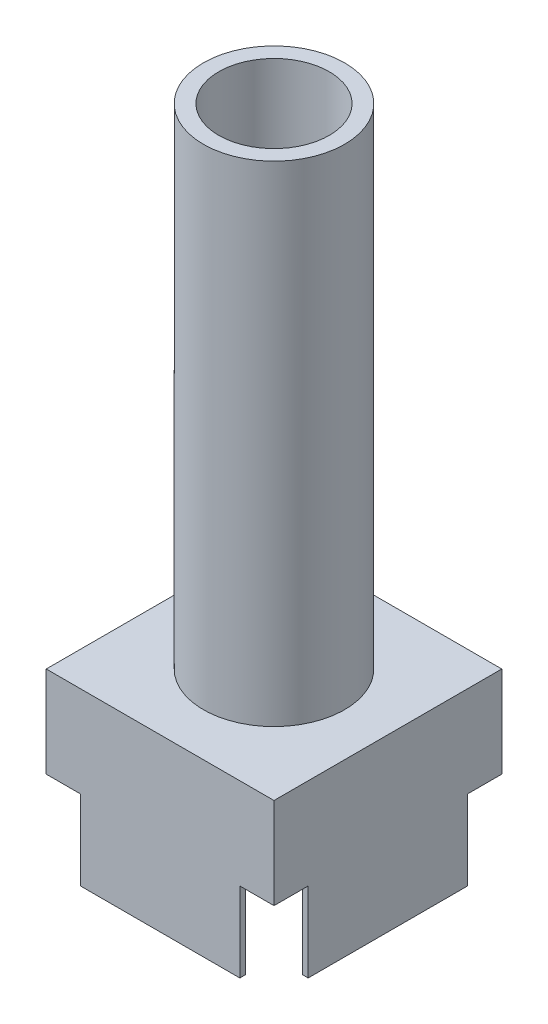
ISO-10303-21;
HEADER;
FILE_DESCRIPTION(('STEP AP214'),'2;1');
FILE_NAME('part.step','',(''),(''),'','','');
FILE_SCHEMA(('AUTOMOTIVE_DESIGN { 1 0 10303 214 1 1 1 1 }'));
ENDSEC;
DATA;
#1=APPLICATION_CONTEXT('core data for automotive mechanical design processes');
#2=APPLICATION_PROTOCOL_DEFINITION('international standard','automotive_design',2000,#1);
#3=PRODUCT_CONTEXT('',#1,'mechanical');
#4=PRODUCT('Part','Part','',(#3));
#5=PRODUCT_RELATED_PRODUCT_CATEGORY('part','',(#4));
#6=PRODUCT_DEFINITION_FORMATION('','',#4);
#7=PRODUCT_DEFINITION_CONTEXT('part definition',#1,'design');
#8=PRODUCT_DEFINITION('design','',#6,#7);
#9=PRODUCT_DEFINITION_SHAPE('','',#8);
#10=(LENGTH_UNIT() NAMED_UNIT(*) SI_UNIT(.MILLI.,.METRE.));
#11=(NAMED_UNIT(*) PLANE_ANGLE_UNIT() SI_UNIT($,.RADIAN.));
#12=(NAMED_UNIT(*) SI_UNIT($,.STERADIAN.) SOLID_ANGLE_UNIT());
#13=UNCERTAINTY_MEASURE_WITH_UNIT(LENGTH_MEASURE(1.E-05),#10,'distance_accuracy_value','');
#14=(GEOMETRIC_REPRESENTATION_CONTEXT(3) GLOBAL_UNCERTAINTY_ASSIGNED_CONTEXT((#13)) GLOBAL_UNIT_ASSIGNED_CONTEXT((#10,
#11,#12)) REPRESENTATION_CONTEXT('',''));
#15=CARTESIAN_POINT('',(0.,0.,0.));
#16=DIRECTION('',(0.,0.,1.));
#17=DIRECTION('',(1.,0.,0.));
#18=AXIS2_PLACEMENT_3D('',#15,#16,#17);
#19=CARTESIAN_POINT('',(0.,0.,0.));
#20=DIRECTION('',(0.,-1.,0.));
#21=DIRECTION('',(0.,0.,-1.));
#22=AXIS2_PLACEMENT_3D('',#19,#20,#21);
#23=PLANE('',#22);
#24=DIRECTION('',(1.,0.,0.));
#25=VECTOR('',#24,1.);
#26=CARTESIAN_POINT('',(0.,0.,-3.));
#27=LINE('',#26,#25);
#28=CARTESIAN_POINT('',(0.,0.,-3.));
#29=VERTEX_POINT('',#28);
#30=CARTESIAN_POINT('',(0.5,0.,-3.));
#31=VERTEX_POINT('',#30);
#32=EDGE_CURVE('E272',#29,#31,#27,.T.);
#33=ORIENTED_EDGE('',*,*,#32,.F.);
#34=DIRECTION('',(0.,0.,1.));
#35=VECTOR('',#34,1.);
#36=CARTESIAN_POINT('',(0.,0.,0.));
#37=LINE('',#36,#35);
#38=CARTESIAN_POINT('',(0.,0.,-17.));
#39=VERTEX_POINT('',#38);
#40=EDGE_CURVE('E324',#39,#29,#37,.T.);
#41=ORIENTED_EDGE('',*,*,#40,.F.);
#42=DIRECTION('',(-1.,0.,0.));
#43=VECTOR('',#42,1.);
#44=CARTESIAN_POINT('',(0.,0.,-17.));
#45=LINE('',#44,#43);
#46=CARTESIAN_POINT('',(0.5,0.,-17.));
#47=VERTEX_POINT('',#46);
#48=EDGE_CURVE('E290',#47,#39,#45,.T.);
#49=ORIENTED_EDGE('',*,*,#48,.F.);
#50=DIRECTION('',(0.,0.,1.));
#51=VECTOR('',#50,1.);
#52=CARTESIAN_POINT('',(0.5,0.,-0.5));
#53=LINE('',#52,#51);
#54=EDGE_CURVE('E312',#47,#31,#53,.T.);
#55=ORIENTED_EDGE('',*,*,#54,.T.);
#56=EDGE_LOOP('',(#33,#41,#49,#55));
#57=FACE_BOUND('',#56,.T.);
#58=ADVANCED_FACE('F33',(#57),#23,.T.);
#59=DIRECTION('',(-1.,0.,0.));
#60=VECTOR('',#59,1.);
#61=CARTESIAN_POINT('',(0.,0.,-17.));
#62=LINE('',#61,#60);
#63=CARTESIAN_POINT('',(20.,0.,-17.));
#64=VERTEX_POINT('',#63);
#65=CARTESIAN_POINT('',(19.5,0.,-17.));
#66=VERTEX_POINT('',#65);
#67=EDGE_CURVE('E264',#64,#66,#62,.T.);
#68=ORIENTED_EDGE('',*,*,#67,.F.);
#69=DIRECTION('',(0.,0.,-1.));
#70=VECTOR('',#69,1.);
#71=CARTESIAN_POINT('',(20.,0.,0.));
#72=LINE('',#71,#70);
#73=CARTESIAN_POINT('',(20.,0.,-3.));
#74=VERTEX_POINT('',#73);
#75=EDGE_CURVE('E338',#74,#64,#72,.T.);
#76=ORIENTED_EDGE('',*,*,#75,.F.);
#77=DIRECTION('',(1.,0.,0.));
#78=VECTOR('',#77,1.);
#79=CARTESIAN_POINT('',(0.,0.,-3.));
#80=LINE('',#79,#78);
#81=CARTESIAN_POINT('',(19.5,0.,-3.));
#82=VERTEX_POINT('',#81);
#83=EDGE_CURVE('E252',#82,#74,#80,.T.);
#84=ORIENTED_EDGE('',*,*,#83,.F.);
#85=DIRECTION('',(0.,0.,-1.));
#86=VECTOR('',#85,1.);
#87=CARTESIAN_POINT('',(19.5,0.,-0.5));
#88=LINE('',#87,#86);
#89=EDGE_CURVE('E330',#82,#66,#88,.T.);
#90=ORIENTED_EDGE('',*,*,#89,.T.);
#91=EDGE_LOOP('',(#68,#76,#84,#90));
#92=FACE_BOUND('',#91,.T.);
#93=ADVANCED_FACE('F381',(#92),#23,.T.);
#94=DIRECTION('',(0.,0.,1.));
#95=VECTOR('',#94,1.);
#96=CARTESIAN_POINT('',(3.,0.,0.));
#97=LINE('',#96,#95);
#98=CARTESIAN_POINT('',(3.,0.,-0.5));
#99=VERTEX_POINT('',#98);
#100=CARTESIAN_POINT('',(3.,0.,0.));
#101=VERTEX_POINT('',#100);
#102=EDGE_CURVE('E268',#99,#101,#97,.T.);
#103=ORIENTED_EDGE('',*,*,#102,.F.);
#104=DIRECTION('',(1.,0.,0.));
#105=VECTOR('',#104,1.);
#106=CARTESIAN_POINT('',(0.5,0.,-0.5));
#107=LINE('',#106,#105);
#108=CARTESIAN_POINT('',(17.,0.,-0.5));
#109=VERTEX_POINT('',#108);
#110=EDGE_CURVE('E327',#99,#109,#107,.T.);
#111=ORIENTED_EDGE('',*,*,#110,.T.);
#112=DIRECTION('',(0.,0.,-1.));
#113=VECTOR('',#112,1.);
#114=CARTESIAN_POINT('',(17.,0.,0.));
#115=LINE('',#114,#113);
#116=CARTESIAN_POINT('',(17.,0.,0.));
#117=VERTEX_POINT('',#116);
#118=EDGE_CURVE('E256',#117,#109,#115,.T.);
#119=ORIENTED_EDGE('',*,*,#118,.F.);
#120=DIRECTION('',(1.,0.,0.));
#121=VECTOR('',#120,1.);
#122=CARTESIAN_POINT('',(0.,0.,0.));
#123=LINE('',#122,#121);
#124=EDGE_CURVE('E335',#101,#117,#123,.T.);
#125=ORIENTED_EDGE('',*,*,#124,.F.);
#126=EDGE_LOOP('',(#103,#111,#119,#125));
#127=FACE_BOUND('',#126,.T.);
#128=ADVANCED_FACE('F386',(#127),#23,.T.);
#129=DIRECTION('',(0.,0.,-1.));
#130=VECTOR('',#129,1.);
#131=CARTESIAN_POINT('',(17.,0.,0.));
#132=LINE('',#131,#130);
#133=CARTESIAN_POINT('',(17.,0.,-19.5));
#134=VERTEX_POINT('',#133);
#135=CARTESIAN_POINT('',(17.,0.,-20.));
#136=VERTEX_POINT('',#135);
#137=EDGE_CURVE('E260',#134,#136,#132,.T.);
#138=ORIENTED_EDGE('',*,*,#137,.F.);
#139=DIRECTION('',(-1.,0.,0.));
#140=VECTOR('',#139,1.);
#141=CARTESIAN_POINT('',(0.5,0.,-19.5));
#142=LINE('',#141,#140);
#143=CARTESIAN_POINT('',(3.,0.,-19.5));
#144=VERTEX_POINT('',#143);
#145=EDGE_CURVE('E317',#134,#144,#142,.T.);
#146=ORIENTED_EDGE('',*,*,#145,.T.);
#147=DIRECTION('',(0.,0.,1.));
#148=VECTOR('',#147,1.);
#149=CARTESIAN_POINT('',(3.,0.,0.));
#150=LINE('',#149,#148);
#151=CARTESIAN_POINT('',(3.,0.,-20.));
#152=VERTEX_POINT('',#151);
#153=EDGE_CURVE('E295',#152,#144,#150,.T.);
#154=ORIENTED_EDGE('',*,*,#153,.F.);
#155=DIRECTION('',(-1.,0.,0.));
#156=VECTOR('',#155,1.);
#157=CARTESIAN_POINT('',(0.,0.,-20.));
#158=LINE('',#157,#156);
#159=EDGE_CURVE('E201',#136,#152,#158,.T.);
#160=ORIENTED_EDGE('',*,*,#159,.F.);
#161=EDGE_LOOP('',(#138,#146,#154,#160));
#162=FACE_BOUND('',#161,.T.);
#163=ADVANCED_FACE('F347',(#162),#23,.T.);
#164=CARTESIAN_POINT('',(0.,7.,0.));
#165=DIRECTION('',(1.,0.,0.));
#166=DIRECTION('',(0.,0.,-1.));
#167=AXIS2_PLACEMENT_3D('',#164,#165,#166);
#168=PLANE('',#167);
#169=ORIENTED_EDGE('',*,*,#40,.T.);
#170=DIRECTION('',(0.,1.,0.));
#171=VECTOR('',#170,1.);
#172=CARTESIAN_POINT('',(0.,-3.,-3.));
#173=LINE('',#172,#171);
#174=CARTESIAN_POINT('',(0.,7.,-3.));
#175=VERTEX_POINT('',#174);
#176=EDGE_CURVE('E193',#29,#175,#173,.T.);
#177=ORIENTED_EDGE('',*,*,#176,.T.);
#178=DIRECTION('',(0.,0.,1.));
#179=VECTOR('',#178,1.);
#180=CARTESIAN_POINT('',(0.,7.,0.));
#181=LINE('',#180,#179);
#182=CARTESIAN_POINT('',(0.,7.,0.));
#183=VERTEX_POINT('',#182);
#184=EDGE_CURVE('E221',#175,#183,#181,.T.);
#185=ORIENTED_EDGE('',*,*,#184,.T.);
#186=DIRECTION('',(0.,-1.,0.));
#187=VECTOR('',#186,1.);
#188=CARTESIAN_POINT('',(0.,7.,0.));
#189=LINE('',#188,#187);
#190=CARTESIAN_POINT('',(0.,15.,0.));
#191=VERTEX_POINT('',#190);
#192=EDGE_CURVE('E41',#191,#183,#189,.T.);
#193=ORIENTED_EDGE('',*,*,#192,.F.);
#194=DIRECTION('',(0.,0.,1.));
#195=VECTOR('',#194,1.);
#196=CARTESIAN_POINT('',(0.,15.,0.));
#197=LINE('',#196,#195);
#198=CARTESIAN_POINT('',(0.,15.,-20.));
#199=VERTEX_POINT('',#198);
#200=EDGE_CURVE('E218',#199,#191,#197,.T.);
#201=ORIENTED_EDGE('',*,*,#200,.F.);
#202=DIRECTION('',(0.,-1.,0.));
#203=VECTOR('',#202,1.);
#204=CARTESIAN_POINT('',(0.,7.,-20.));
#205=LINE('',#204,#203);
#206=CARTESIAN_POINT('',(0.,7.,-20.));
#207=VERTEX_POINT('',#206);
#208=EDGE_CURVE('E56',#199,#207,#205,.T.);
#209=ORIENTED_EDGE('',*,*,#208,.T.);
#210=DIRECTION('',(0.,0.,1.));
#211=VECTOR('',#210,1.);
#212=CARTESIAN_POINT('',(0.,7.,-20.));
#213=LINE('',#212,#211);
#214=CARTESIAN_POINT('',(0.,7.,-17.));
#215=VERTEX_POINT('',#214);
#216=EDGE_CURVE('E274',#207,#215,#213,.T.);
#217=ORIENTED_EDGE('',*,*,#216,.T.);
#218=DIRECTION('',(0.,1.,0.));
#219=VECTOR('',#218,1.);
#220=CARTESIAN_POINT('',(0.,-3.,-17.));
#221=LINE('',#220,#219);
#222=EDGE_CURVE('E283',#39,#215,#221,.T.);
#223=ORIENTED_EDGE('',*,*,#222,.F.);
#224=EDGE_LOOP('',(#169,#177,#185,#193,#201,#209,#217,#223));
#225=FACE_BOUND('',#224,.T.);
#226=ADVANCED_FACE('F35',(#225),#168,.F.);
#227=CARTESIAN_POINT('',(0.,7.,0.));
#228=DIRECTION('',(0.,0.,-1.));
#229=DIRECTION('',(-1.,0.,0.));
#230=AXIS2_PLACEMENT_3D('',#227,#228,#229);
#231=PLANE('',#230);
#232=DIRECTION('',(1.,0.,0.));
#233=VECTOR('',#232,1.);
#234=CARTESIAN_POINT('',(0.,7.,0.));
#235=LINE('',#234,#233);
#236=CARTESIAN_POINT('',(3.,7.,0.));
#237=VERTEX_POINT('',#236);
#238=EDGE_CURVE('E210',#183,#237,#235,.T.);
#239=ORIENTED_EDGE('',*,*,#238,.T.);
#240=DIRECTION('',(0.,1.,0.));
#241=VECTOR('',#240,1.);
#242=CARTESIAN_POINT('',(3.,-3.,0.));
#243=LINE('',#242,#241);
#244=EDGE_CURVE('E232',#101,#237,#243,.T.);
#245=ORIENTED_EDGE('',*,*,#244,.F.);
#246=ORIENTED_EDGE('',*,*,#124,.T.);
#247=DIRECTION('',(0.,1.,0.));
#248=VECTOR('',#247,1.);
#249=CARTESIAN_POINT('',(17.,-3.,0.));
#250=LINE('',#249,#248);
#251=CARTESIAN_POINT('',(17.,7.,0.));
#252=VERTEX_POINT('',#251);
#253=EDGE_CURVE('E246',#117,#252,#250,.T.);
#254=ORIENTED_EDGE('',*,*,#253,.T.);
#255=DIRECTION('',(1.,0.,0.));
#256=VECTOR('',#255,1.);
#257=CARTESIAN_POINT('',(20.,7.,0.));
#258=LINE('',#257,#256);
#259=CARTESIAN_POINT('',(20.,7.,0.));
#260=VERTEX_POINT('',#259);
#261=EDGE_CURVE('E242',#252,#260,#258,.T.);
#262=ORIENTED_EDGE('',*,*,#261,.T.);
#263=DIRECTION('',(0.,-1.,0.));
#264=VECTOR('',#263,1.);
#265=CARTESIAN_POINT('',(20.,7.,0.));
#266=LINE('',#265,#264);
#267=CARTESIAN_POINT('',(20.,15.,0.));
#268=VERTEX_POINT('',#267);
#269=EDGE_CURVE('E197',#268,#260,#266,.T.);
#270=ORIENTED_EDGE('',*,*,#269,.F.);
#271=DIRECTION('',(1.,0.,0.));
#272=VECTOR('',#271,1.);
#273=CARTESIAN_POINT('',(0.,15.,0.));
#274=LINE('',#273,#272);
#275=EDGE_CURVE('E212',#191,#268,#274,.T.);
#276=ORIENTED_EDGE('',*,*,#275,.F.);
#277=ORIENTED_EDGE('',*,*,#192,.T.);
#278=EDGE_LOOP('',(#239,#245,#246,#254,#262,#270,#276,#277));
#279=FACE_BOUND('',#278,.T.);
#280=ADVANCED_FACE('F208',(#279),#231,.F.);
#281=CARTESIAN_POINT('',(20.,7.,0.));
#282=DIRECTION('',(-1.,0.,0.));
#283=DIRECTION('',(0.,0.,1.));
#284=AXIS2_PLACEMENT_3D('',#281,#282,#283);
#285=PLANE('',#284);
#286=ORIENTED_EDGE('',*,*,#75,.T.);
#287=DIRECTION('',(0.,1.,0.));
#288=VECTOR('',#287,1.);
#289=CARTESIAN_POINT('',(20.,-3.,-17.));
#290=LINE('',#289,#288);
#291=CARTESIAN_POINT('',(20.,7.,-17.));
#292=VERTEX_POINT('',#291);
#293=EDGE_CURVE('E192',#64,#292,#290,.T.);
#294=ORIENTED_EDGE('',*,*,#293,.T.);
#295=DIRECTION('',(0.,0.,-1.));
#296=VECTOR('',#295,1.);
#297=CARTESIAN_POINT('',(20.,7.,-20.));
#298=LINE('',#297,#296);
#299=CARTESIAN_POINT('',(20.,7.,-20.));
#300=VERTEX_POINT('',#299);
#301=EDGE_CURVE('E180',#292,#300,#298,.T.);
#302=ORIENTED_EDGE('',*,*,#301,.T.);
#303=DIRECTION('',(0.,-1.,0.));
#304=VECTOR('',#303,1.);
#305=CARTESIAN_POINT('',(20.,7.,-20.));
#306=LINE('',#305,#304);
#307=CARTESIAN_POINT('',(20.,15.,-20.));
#308=VERTEX_POINT('',#307);
#309=EDGE_CURVE('E190',#308,#300,#306,.T.);
#310=ORIENTED_EDGE('',*,*,#309,.F.);
#311=DIRECTION('',(0.,0.,-1.));
#312=VECTOR('',#311,1.);
#313=CARTESIAN_POINT('',(20.,15.,0.));
#314=LINE('',#313,#312);
#315=EDGE_CURVE('E309',#268,#308,#314,.T.);
#316=ORIENTED_EDGE('',*,*,#315,.F.);
#317=ORIENTED_EDGE('',*,*,#269,.T.);
#318=DIRECTION('',(0.,0.,-1.));
#319=VECTOR('',#318,1.);
#320=CARTESIAN_POINT('',(20.,7.,0.));
#321=LINE('',#320,#319);
#322=CARTESIAN_POINT('',(20.,7.,-3.));
#323=VERTEX_POINT('',#322);
#324=EDGE_CURVE('E235',#260,#323,#321,.T.);
#325=ORIENTED_EDGE('',*,*,#324,.T.);
#326=DIRECTION('',(0.,1.,0.));
#327=VECTOR('',#326,1.);
#328=CARTESIAN_POINT('',(20.,-3.,-3.));
#329=LINE('',#328,#327);
#330=EDGE_CURVE('E245',#74,#323,#329,.T.);
#331=ORIENTED_EDGE('',*,*,#330,.F.);
#332=EDGE_LOOP('',(#286,#294,#302,#310,#316,#317,#325,#331));
#333=FACE_BOUND('',#332,.T.);
#334=ADVANCED_FACE('F188',(#333),#285,.F.);
#335=CARTESIAN_POINT('',(0.,7.,-20.));
#336=DIRECTION('',(0.,0.,1.));
#337=DIRECTION('',(1.,0.,0.));
#338=AXIS2_PLACEMENT_3D('',#335,#336,#337);
#339=PLANE('',#338);
#340=DIRECTION('',(-1.,0.,0.));
#341=VECTOR('',#340,1.);
#342=CARTESIAN_POINT('',(20.,7.,-20.));
#343=LINE('',#342,#341);
#344=CARTESIAN_POINT('',(17.,7.,-20.));
#345=VERTEX_POINT('',#344);
#346=EDGE_CURVE('E175',#300,#345,#343,.T.);
#347=ORIENTED_EDGE('',*,*,#346,.T.);
#348=DIRECTION('',(0.,1.,0.));
#349=VECTOR('',#348,1.);
#350=CARTESIAN_POINT('',(17.,-3.,-20.));
#351=LINE('',#350,#349);
#352=EDGE_CURVE('E226',#136,#345,#351,.T.);
#353=ORIENTED_EDGE('',*,*,#352,.F.);
#354=ORIENTED_EDGE('',*,*,#159,.T.);
#355=DIRECTION('',(0.,1.,0.));
#356=VECTOR('',#355,1.);
#357=CARTESIAN_POINT('',(3.,-3.,-20.));
#358=LINE('',#357,#356);
#359=CARTESIAN_POINT('',(3.,7.,-20.));
#360=VERTEX_POINT('',#359);
#361=EDGE_CURVE('E284',#152,#360,#358,.T.);
#362=ORIENTED_EDGE('',*,*,#361,.T.);
#363=DIRECTION('',(-1.,0.,0.));
#364=VECTOR('',#363,1.);
#365=CARTESIAN_POINT('',(0.,7.,-20.));
#366=LINE('',#365,#364);
#367=EDGE_CURVE('E281',#360,#207,#366,.T.);
#368=ORIENTED_EDGE('',*,*,#367,.T.);
#369=ORIENTED_EDGE('',*,*,#208,.F.);
#370=DIRECTION('',(-1.,0.,0.));
#371=VECTOR('',#370,1.);
#372=CARTESIAN_POINT('',(0.,15.,-20.));
#373=LINE('',#372,#371);
#374=EDGE_CURVE('E196',#308,#199,#373,.T.);
#375=ORIENTED_EDGE('',*,*,#374,.F.);
#376=ORIENTED_EDGE('',*,*,#309,.T.);
#377=EDGE_LOOP('',(#347,#353,#354,#362,#368,#369,#375,#376));
#378=FACE_BOUND('',#377,.T.);
#379=ADVANCED_FACE('F195',(#378),#339,.F.);
#380=CARTESIAN_POINT('',(0.5,7.,-0.5));
#381=DIRECTION('',(1.,0.,0.));
#382=DIRECTION('',(0.,0.,-1.));
#383=AXIS2_PLACEMENT_3D('',#380,#381,#382);
#384=PLANE('',#383);
#385=DIRECTION('',(0.,1.,0.));
#386=VECTOR('',#385,1.);
#387=CARTESIAN_POINT('',(0.5,7.,-3.));
#388=LINE('',#387,#386);
#389=CARTESIAN_POINT('',(0.5,7.,-3.));
#390=VERTEX_POINT('',#389);
#391=EDGE_CURVE('E270',#31,#390,#388,.T.);
#392=ORIENTED_EDGE('',*,*,#391,.F.);
#393=ORIENTED_EDGE('',*,*,#54,.F.);
#394=DIRECTION('',(0.,-1.,0.));
#395=VECTOR('',#394,1.);
#396=CARTESIAN_POINT('',(0.5,7.,-17.));
#397=LINE('',#396,#395);
#398=CARTESIAN_POINT('',(0.5,7.,-17.));
#399=VERTEX_POINT('',#398);
#400=EDGE_CURVE('E287',#399,#47,#397,.T.);
#401=ORIENTED_EDGE('',*,*,#400,.F.);
#402=DIRECTION('',(0.,0.,1.));
#403=VECTOR('',#402,1.);
#404=CARTESIAN_POINT('',(0.5,7.,-0.5));
#405=LINE('',#404,#403);
#406=EDGE_CURVE('E313',#399,#390,#405,.T.);
#407=ORIENTED_EDGE('',*,*,#406,.T.);
#408=EDGE_LOOP('',(#392,#393,#401,#407));
#409=FACE_BOUND('',#408,.T.);
#410=ADVANCED_FACE('F363',(#409),#384,.T.);
#411=CARTESIAN_POINT('',(0.5,7.,-0.5));
#412=DIRECTION('',(0.,0.,-1.));
#413=DIRECTION('',(-1.,0.,0.));
#414=AXIS2_PLACEMENT_3D('',#411,#412,#413);
#415=PLANE('',#414);
#416=DIRECTION('',(0.,-1.,0.));
#417=VECTOR('',#416,1.);
#418=CARTESIAN_POINT('',(3.,7.,-0.5));
#419=LINE('',#418,#417);
#420=CARTESIAN_POINT('',(3.,7.,-0.5));
#421=VERTEX_POINT('',#420);
#422=EDGE_CURVE('E266',#421,#99,#419,.T.);
#423=ORIENTED_EDGE('',*,*,#422,.F.);
#424=DIRECTION('',(1.,0.,0.));
#425=VECTOR('',#424,1.);
#426=CARTESIAN_POINT('',(0.5,7.,-0.5));
#427=LINE('',#426,#425);
#428=CARTESIAN_POINT('',(17.,7.,-0.5));
#429=VERTEX_POINT('',#428);
#430=EDGE_CURVE('E316',#421,#429,#427,.T.);
#431=ORIENTED_EDGE('',*,*,#430,.T.);
#432=DIRECTION('',(0.,1.,0.));
#433=VECTOR('',#432,1.);
#434=CARTESIAN_POINT('',(17.,7.,-0.5));
#435=LINE('',#434,#433);
#436=EDGE_CURVE('E254',#109,#429,#435,.T.);
#437=ORIENTED_EDGE('',*,*,#436,.F.);
#438=ORIENTED_EDGE('',*,*,#110,.F.);
#439=EDGE_LOOP('',(#423,#431,#437,#438));
#440=FACE_BOUND('',#439,.T.);
#441=ADVANCED_FACE('F406',(#440),#415,.T.);
#442=CARTESIAN_POINT('',(19.5,7.,-0.5));
#443=DIRECTION('',(-1.,0.,0.));
#444=DIRECTION('',(0.,0.,1.));
#445=AXIS2_PLACEMENT_3D('',#442,#443,#444);
#446=PLANE('',#445);
#447=DIRECTION('',(0.,1.,0.));
#448=VECTOR('',#447,1.);
#449=CARTESIAN_POINT('',(19.5,7.,-17.));
#450=LINE('',#449,#448);
#451=CARTESIAN_POINT('',(19.5,7.,-17.));
#452=VERTEX_POINT('',#451);
#453=EDGE_CURVE('E262',#66,#452,#450,.T.);
#454=ORIENTED_EDGE('',*,*,#453,.F.);
#455=ORIENTED_EDGE('',*,*,#89,.F.);
#456=DIRECTION('',(0.,-1.,0.));
#457=VECTOR('',#456,1.);
#458=CARTESIAN_POINT('',(19.5,7.,-3.));
#459=LINE('',#458,#457);
#460=CARTESIAN_POINT('',(19.5,7.,-3.));
#461=VERTEX_POINT('',#460);
#462=EDGE_CURVE('E249',#461,#82,#459,.T.);
#463=ORIENTED_EDGE('',*,*,#462,.F.);
#464=DIRECTION('',(0.,0.,-1.));
#465=VECTOR('',#464,1.);
#466=CARTESIAN_POINT('',(19.5,7.,-0.5));
#467=LINE('',#466,#465);
#468=EDGE_CURVE('E320',#461,#452,#467,.T.);
#469=ORIENTED_EDGE('',*,*,#468,.T.);
#470=EDGE_LOOP('',(#454,#455,#463,#469));
#471=FACE_BOUND('',#470,.T.);
#472=ADVANCED_FACE('F438',(#471),#446,.T.);
#473=CARTESIAN_POINT('',(0.5,7.,-19.5));
#474=DIRECTION('',(0.,0.,1.));
#475=DIRECTION('',(1.,0.,0.));
#476=AXIS2_PLACEMENT_3D('',#473,#474,#475);
#477=PLANE('',#476);
#478=DIRECTION('',(0.,-1.,0.));
#479=VECTOR('',#478,1.);
#480=CARTESIAN_POINT('',(17.,7.,-19.5));
#481=LINE('',#480,#479);
#482=CARTESIAN_POINT('',(17.,7.,-19.5));
#483=VERTEX_POINT('',#482);
#484=EDGE_CURVE('E258',#483,#134,#481,.T.);
#485=ORIENTED_EDGE('',*,*,#484,.F.);
#486=DIRECTION('',(-1.,0.,0.));
#487=VECTOR('',#486,1.);
#488=CARTESIAN_POINT('',(0.5,7.,-19.5));
#489=LINE('',#488,#487);
#490=CARTESIAN_POINT('',(3.,7.,-19.5));
#491=VERTEX_POINT('',#490);
#492=EDGE_CURVE('E48',#483,#491,#489,.T.);
#493=ORIENTED_EDGE('',*,*,#492,.T.);
#494=DIRECTION('',(0.,1.,0.));
#495=VECTOR('',#494,1.);
#496=CARTESIAN_POINT('',(3.,7.,-19.5));
#497=LINE('',#496,#495);
#498=EDGE_CURVE('E292',#144,#491,#497,.T.);
#499=ORIENTED_EDGE('',*,*,#498,.F.);
#500=ORIENTED_EDGE('',*,*,#145,.F.);
#501=EDGE_LOOP('',(#485,#493,#499,#500));
#502=FACE_BOUND('',#501,.T.);
#503=ADVANCED_FACE('F349',(#502),#477,.T.);
#504=CARTESIAN_POINT('',(0.,7.,0.));
#505=DIRECTION('',(0.,-1.,0.));
#506=DIRECTION('',(0.,0.,-1.));
#507=AXIS2_PLACEMENT_3D('',#504,#505,#506);
#508=PLANE('',#507);
#509=DIRECTION('',(-1.,0.,0.));
#510=VECTOR('',#509,1.);
#511=CARTESIAN_POINT('',(0.,7.,-3.));
#512=LINE('',#511,#510);
#513=EDGE_CURVE('E230',#390,#175,#512,.T.);
#514=ORIENTED_EDGE('',*,*,#513,.F.);
#515=ORIENTED_EDGE('',*,*,#406,.F.);
#516=DIRECTION('',(1.,0.,0.));
#517=VECTOR('',#516,1.);
#518=CARTESIAN_POINT('',(0.,7.,-17.));
#519=LINE('',#518,#517);
#520=EDGE_CURVE('E277',#215,#399,#519,.T.);
#521=ORIENTED_EDGE('',*,*,#520,.F.);
#522=ORIENTED_EDGE('',*,*,#216,.F.);
#523=ORIENTED_EDGE('',*,*,#367,.F.);
#524=DIRECTION('',(0.,0.,-1.));
#525=VECTOR('',#524,1.);
#526=CARTESIAN_POINT('',(3.,7.,-20.));
#527=LINE('',#526,#525);
#528=EDGE_CURVE('E279',#491,#360,#527,.T.);
#529=ORIENTED_EDGE('',*,*,#528,.F.);
#530=ORIENTED_EDGE('',*,*,#492,.F.);
#531=DIRECTION('',(0.,0.,1.));
#532=VECTOR('',#531,1.);
#533=CARTESIAN_POINT('',(17.,7.,-20.));
#534=LINE('',#533,#532);
#535=EDGE_CURVE('E182',#345,#483,#534,.T.);
#536=ORIENTED_EDGE('',*,*,#535,.F.);
#537=ORIENTED_EDGE('',*,*,#346,.F.);
#538=ORIENTED_EDGE('',*,*,#301,.F.);
#539=DIRECTION('',(1.,0.,0.));
#540=VECTOR('',#539,1.);
#541=CARTESIAN_POINT('',(20.,7.,-17.));
#542=LINE('',#541,#540);
#543=EDGE_CURVE('E440',#452,#292,#542,.T.);
#544=ORIENTED_EDGE('',*,*,#543,.F.);
#545=ORIENTED_EDGE('',*,*,#468,.F.);
#546=DIRECTION('',(-1.,0.,0.));
#547=VECTOR('',#546,1.);
#548=CARTESIAN_POINT('',(20.,7.,-3.));
#549=LINE('',#548,#547);
#550=EDGE_CURVE('E238',#323,#461,#549,.T.);
#551=ORIENTED_EDGE('',*,*,#550,.F.);
#552=ORIENTED_EDGE('',*,*,#324,.F.);
#553=ORIENTED_EDGE('',*,*,#261,.F.);
#554=DIRECTION('',(0.,0.,1.));
#555=VECTOR('',#554,1.);
#556=CARTESIAN_POINT('',(17.,7.,0.));
#557=LINE('',#556,#555);
#558=EDGE_CURVE('E240',#429,#252,#557,.T.);
#559=ORIENTED_EDGE('',*,*,#558,.F.);
#560=ORIENTED_EDGE('',*,*,#430,.F.);
#561=DIRECTION('',(0.,0.,-1.));
#562=VECTOR('',#561,1.);
#563=CARTESIAN_POINT('',(3.,7.,0.));
#564=LINE('',#563,#562);
#565=EDGE_CURVE('E223',#237,#421,#564,.T.);
#566=ORIENTED_EDGE('',*,*,#565,.F.);
#567=ORIENTED_EDGE('',*,*,#238,.F.);
#568=ORIENTED_EDGE('',*,*,#184,.F.);
#569=EDGE_LOOP('',(#514,#515,#521,#522,#523,#529,#530,#536,#537,#538,#544,#545,#551,#552,#553,
#559,#560,#566,#567,#568));
#570=FACE_BOUND('',#569,.T.);
#571=ADVANCED_FACE('F178',(#570),#508,.T.);
#572=CARTESIAN_POINT('',(0.,15.,0.));
#573=DIRECTION('',(0.,-1.,0.));
#574=DIRECTION('',(0.,0.,-1.));
#575=AXIS2_PLACEMENT_3D('',#572,#573,#574);
#576=PLANE('',#575);
#577=CARTESIAN_POINT('',(10.,15.,-10.));
#578=DIRECTION('',(0.,-1.,0.));
#579=DIRECTION('',(0.,0.,-1.));
#580=AXIS2_PLACEMENT_3D('',#577,#578,#579);
#581=CIRCLE('',#580,6.2);
#582=CARTESIAN_POINT('',(10.,15.,-16.2));
#583=VERTEX_POINT('',#582);
#584=EDGE_CURVE('E11',#583,#583,#581,.F.);
#585=ORIENTED_EDGE('',*,*,#584,.F.);
#586=EDGE_LOOP('',(#585));
#587=FACE_BOUND('',#586,.T.);
#588=ORIENTED_EDGE('',*,*,#200,.T.);
#589=ORIENTED_EDGE('',*,*,#275,.T.);
#590=ORIENTED_EDGE('',*,*,#315,.T.);
#591=ORIENTED_EDGE('',*,*,#374,.T.);
#592=EDGE_LOOP('',(#588,#589,#590,#591));
#593=FACE_BOUND('',#592,.T.);
#594=ADVANCED_FACE('F492',(#587,#593),#576,.F.);
#595=CARTESIAN_POINT('',(10.,58.,-10.));
#596=DIRECTION('',(0.,-1.,0.));
#597=DIRECTION('',(0.,0.,-1.));
#598=AXIS2_PLACEMENT_3D('',#595,#596,#597);
#599=CYLINDRICAL_SURFACE('',#598,6.2);
#600=CARTESIAN_POINT('',(10.,58.,-10.));
#601=DIRECTION('',(0.,1.,0.));
#602=DIRECTION('',(0.,0.,1.));
#603=AXIS2_PLACEMENT_3D('',#600,#601,#602);
#604=CIRCLE('',#603,6.2);
#605=CARTESIAN_POINT('',(10.,58.,-3.8));
#606=VERTEX_POINT('',#605);
#607=EDGE_CURVE('E302',#606,#606,#604,.T.);
#608=ORIENTED_EDGE('',*,*,#607,.F.);
#609=EDGE_LOOP('',(#608));
#610=FACE_BOUND('',#609,.T.);
#611=ORIENTED_EDGE('',*,*,#584,.T.);
#612=EDGE_LOOP('',(#611));
#613=FACE_BOUND('',#612,.T.);
#614=ADVANCED_FACE('F535',(#610,#613),#599,.T.);
#615=CARTESIAN_POINT('',(10.,58.,-10.));
#616=DIRECTION('',(0.,1.,0.));
#617=DIRECTION('',(0.,0.,1.));
#618=AXIS2_PLACEMENT_3D('',#615,#616,#617);
#619=PLANE('',#618);
#620=CARTESIAN_POINT('',(10.,58.,-10.));
#621=DIRECTION('',(0.,1.,0.));
#622=DIRECTION('',(0.,0.,1.));
#623=AXIS2_PLACEMENT_3D('',#620,#621,#622);
#624=CIRCLE('',#623,4.85);
#625=CARTESIAN_POINT('',(10.,58.,-5.15));
#626=VERTEX_POINT('',#625);
#627=EDGE_CURVE('E298',#626,#626,#624,.T.);
#628=ORIENTED_EDGE('',*,*,#627,.F.);
#629=EDGE_LOOP('',(#628));
#630=FACE_BOUND('',#629,.T.);
#631=ORIENTED_EDGE('',*,*,#607,.T.);
#632=EDGE_LOOP('',(#631));
#633=FACE_BOUND('',#632,.T.);
#634=ADVANCED_FACE('F526',(#630,#633),#619,.T.);
#635=CARTESIAN_POINT('',(10.,40.,-10.));
#636=DIRECTION('',(0.,1.,0.));
#637=DIRECTION('',(0.,0.,1.));
#638=AXIS2_PLACEMENT_3D('',#635,#636,#637);
#639=CYLINDRICAL_SURFACE('',#638,4.85);
#640=CARTESIAN_POINT('',(10.,40.,-10.));
#641=DIRECTION('',(0.,1.,0.));
#642=DIRECTION('',(0.,0.,1.));
#643=AXIS2_PLACEMENT_3D('',#640,#641,#642);
#644=CIRCLE('',#643,4.85);
#645=CARTESIAN_POINT('',(10.,40.,-5.15));
#646=VERTEX_POINT('',#645);
#647=EDGE_CURVE('E299',#646,#646,#644,.T.);
#648=ORIENTED_EDGE('',*,*,#647,.F.);
#649=EDGE_LOOP('',(#648));
#650=FACE_BOUND('',#649,.T.);
#651=ORIENTED_EDGE('',*,*,#627,.T.);
#652=EDGE_LOOP('',(#651));
#653=FACE_BOUND('',#652,.T.);
#654=ADVANCED_FACE('F518',(#650,#653),#639,.F.);
#655=CARTESIAN_POINT('',(0.,40.,0.));
#656=DIRECTION('',(0.,1.,0.));
#657=DIRECTION('',(0.,0.,1.));
#658=AXIS2_PLACEMENT_3D('',#655,#656,#657);
#659=PLANE('',#658);
#660=ORIENTED_EDGE('',*,*,#647,.T.);
#661=EDGE_LOOP('',(#660));
#662=FACE_BOUND('',#661,.T.);
#663=ADVANCED_FACE('F377',(#662),#659,.T.);
#664=CARTESIAN_POINT('',(3.,-3.,-20.));
#665=DIRECTION('',(1.,0.,0.));
#666=DIRECTION('',(0.,0.,-1.));
#667=AXIS2_PLACEMENT_3D('',#664,#665,#666);
#668=PLANE('',#667);
#669=ORIENTED_EDGE('',*,*,#153,.T.);
#670=ORIENTED_EDGE('',*,*,#498,.T.);
#671=ORIENTED_EDGE('',*,*,#528,.T.);
#672=ORIENTED_EDGE('',*,*,#361,.F.);
#673=EDGE_LOOP('',(#669,#670,#671,#672));
#674=FACE_BOUND('',#673,.T.);
#675=ADVANCED_FACE('F345',(#674),#668,.F.);
#676=CARTESIAN_POINT('',(0.,-3.,-17.));
#677=DIRECTION('',(0.,0.,1.));
#678=DIRECTION('',(1.,0.,0.));
#679=AXIS2_PLACEMENT_3D('',#676,#677,#678);
#680=PLANE('',#679);
#681=ORIENTED_EDGE('',*,*,#48,.T.);
#682=ORIENTED_EDGE('',*,*,#222,.T.);
#683=ORIENTED_EDGE('',*,*,#520,.T.);
#684=ORIENTED_EDGE('',*,*,#400,.T.);
#685=EDGE_LOOP('',(#681,#682,#683,#684));
#686=FACE_BOUND('',#685,.T.);
#687=ADVANCED_FACE('F366',(#686),#680,.F.);
#688=CARTESIAN_POINT('',(20.,-3.,-17.));
#689=DIRECTION('',(0.,0.,1.));
#690=DIRECTION('',(1.,0.,0.));
#691=AXIS2_PLACEMENT_3D('',#688,#689,#690);
#692=PLANE('',#691);
#693=ORIENTED_EDGE('',*,*,#67,.T.);
#694=ORIENTED_EDGE('',*,*,#453,.T.);
#695=ORIENTED_EDGE('',*,*,#543,.T.);
#696=ORIENTED_EDGE('',*,*,#293,.F.);
#697=EDGE_LOOP('',(#693,#694,#695,#696));
#698=FACE_BOUND('',#697,.T.);
#699=ADVANCED_FACE('F368',(#698),#692,.F.);
#700=CARTESIAN_POINT('',(17.,-3.,-20.));
#701=DIRECTION('',(-1.,0.,0.));
#702=DIRECTION('',(0.,0.,1.));
#703=AXIS2_PLACEMENT_3D('',#700,#701,#702);
#704=PLANE('',#703);
#705=ORIENTED_EDGE('',*,*,#137,.T.);
#706=ORIENTED_EDGE('',*,*,#352,.T.);
#707=ORIENTED_EDGE('',*,*,#535,.T.);
#708=ORIENTED_EDGE('',*,*,#484,.T.);
#709=EDGE_LOOP('',(#705,#706,#707,#708));
#710=FACE_BOUND('',#709,.T.);
#711=ADVANCED_FACE('F374',(#710),#704,.F.);
#712=CARTESIAN_POINT('',(17.,-3.,0.));
#713=DIRECTION('',(-1.,0.,0.));
#714=DIRECTION('',(0.,0.,1.));
#715=AXIS2_PLACEMENT_3D('',#712,#713,#714);
#716=PLANE('',#715);
#717=ORIENTED_EDGE('',*,*,#118,.T.);
#718=ORIENTED_EDGE('',*,*,#436,.T.);
#719=ORIENTED_EDGE('',*,*,#558,.T.);
#720=ORIENTED_EDGE('',*,*,#253,.F.);
#721=EDGE_LOOP('',(#717,#718,#719,#720));
#722=FACE_BOUND('',#721,.T.);
#723=ADVANCED_FACE('F410',(#722),#716,.F.);
#724=CARTESIAN_POINT('',(20.,-3.,-3.));
#725=DIRECTION('',(0.,0.,-1.));
#726=DIRECTION('',(-1.,0.,0.));
#727=AXIS2_PLACEMENT_3D('',#724,#725,#726);
#728=PLANE('',#727);
#729=ORIENTED_EDGE('',*,*,#83,.T.);
#730=ORIENTED_EDGE('',*,*,#330,.T.);
#731=ORIENTED_EDGE('',*,*,#550,.T.);
#732=ORIENTED_EDGE('',*,*,#462,.T.);
#733=EDGE_LOOP('',(#729,#730,#731,#732));
#734=FACE_BOUND('',#733,.T.);
#735=ADVANCED_FACE('F420',(#734),#728,.F.);
#736=CARTESIAN_POINT('',(0.,-3.,-3.));
#737=DIRECTION('',(0.,0.,-1.));
#738=DIRECTION('',(-1.,0.,0.));
#739=AXIS2_PLACEMENT_3D('',#736,#737,#738);
#740=PLANE('',#739);
#741=ORIENTED_EDGE('',*,*,#32,.T.);
#742=ORIENTED_EDGE('',*,*,#391,.T.);
#743=ORIENTED_EDGE('',*,*,#513,.T.);
#744=ORIENTED_EDGE('',*,*,#176,.F.);
#745=EDGE_LOOP('',(#741,#742,#743,#744));
#746=FACE_BOUND('',#745,.T.);
#747=ADVANCED_FACE('F361',(#746),#740,.F.);
#748=CARTESIAN_POINT('',(3.,-3.,0.));
#749=DIRECTION('',(1.,0.,0.));
#750=DIRECTION('',(0.,0.,-1.));
#751=AXIS2_PLACEMENT_3D('',#748,#749,#750);
#752=PLANE('',#751);
#753=ORIENTED_EDGE('',*,*,#102,.T.);
#754=ORIENTED_EDGE('',*,*,#244,.T.);
#755=ORIENTED_EDGE('',*,*,#565,.T.);
#756=ORIENTED_EDGE('',*,*,#422,.T.);
#757=EDGE_LOOP('',(#753,#754,#755,#756));
#758=FACE_BOUND('',#757,.T.);
#759=ADVANCED_FACE('F414',(#758),#752,.F.);
#760=CLOSED_SHELL('',(#58,#93,#128,#163,#226,#280,#334,#379,#410,#441,#472,#503,#571,#594,#614,
#634,#654,#663,#675,#687,#699,#711,#723,#735,#747,#759));
#761=MANIFOLD_SOLID_BREP('B2',#760);
#762=ADVANCED_BREP_SHAPE_REPRESENTATION('',(#18,#761),#14);
#763=SHAPE_DEFINITION_REPRESENTATION(#9,#762);
ENDSEC;
END-ISO-10303-21;
